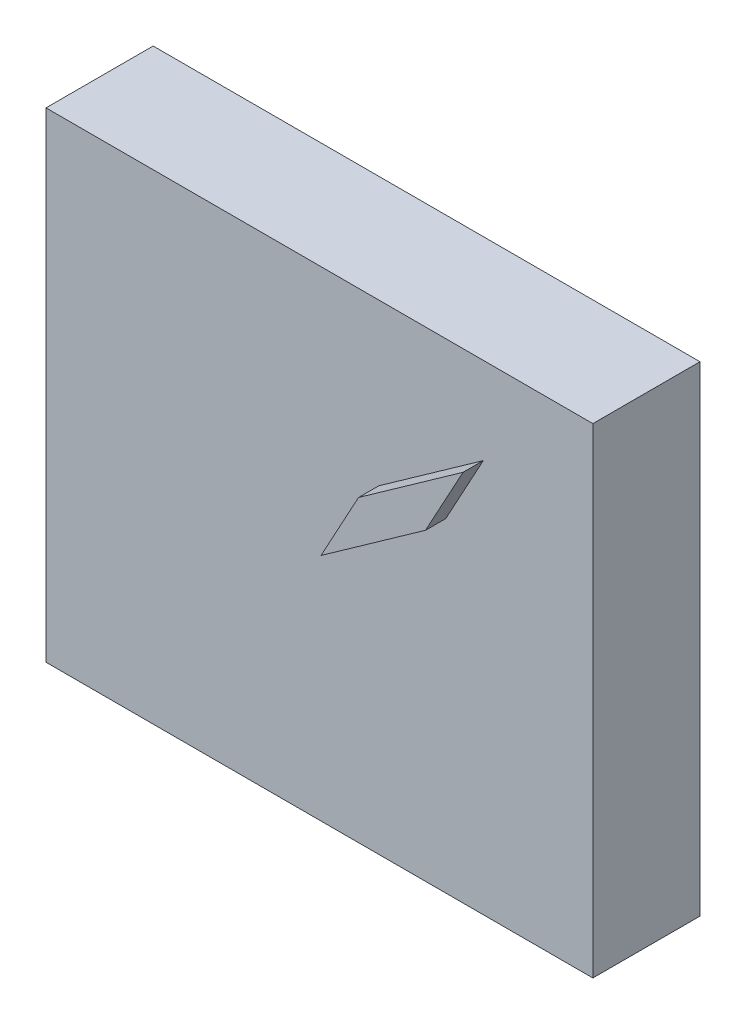
ISO-10303-21;
HEADER;
FILE_DESCRIPTION(('STEP AP214'),'2;1');
FILE_NAME('part.step','',(''),(''),'','','');
FILE_SCHEMA(('AUTOMOTIVE_DESIGN { 1 0 10303 214 1 1 1 1 }'));
ENDSEC;
DATA;
#1=APPLICATION_CONTEXT('core data for automotive mechanical design processes');
#2=APPLICATION_PROTOCOL_DEFINITION('international standard','automotive_design',2000,#1);
#3=PRODUCT_CONTEXT('',#1,'mechanical');
#4=PRODUCT('Part','Part','',(#3));
#5=PRODUCT_RELATED_PRODUCT_CATEGORY('part','',(#4));
#6=PRODUCT_DEFINITION_FORMATION('','',#4);
#7=PRODUCT_DEFINITION_CONTEXT('part definition',#1,'design');
#8=PRODUCT_DEFINITION('design','',#6,#7);
#9=PRODUCT_DEFINITION_SHAPE('','',#8);
#10=(LENGTH_UNIT() NAMED_UNIT(*) SI_UNIT(.MILLI.,.METRE.));
#11=(NAMED_UNIT(*) PLANE_ANGLE_UNIT() SI_UNIT($,.RADIAN.));
#12=(NAMED_UNIT(*) SI_UNIT($,.STERADIAN.) SOLID_ANGLE_UNIT());
#13=UNCERTAINTY_MEASURE_WITH_UNIT(LENGTH_MEASURE(1.E-05),#10,'distance_accuracy_value','');
#14=(GEOMETRIC_REPRESENTATION_CONTEXT(3) GLOBAL_UNCERTAINTY_ASSIGNED_CONTEXT((#13)) GLOBAL_UNIT_ASSIGNED_CONTEXT((#10,
#11,#12)) REPRESENTATION_CONTEXT('',''));
#15=CARTESIAN_POINT('',(0.,0.,0.));
#16=DIRECTION('',(0.,0.,1.));
#17=DIRECTION('',(1.,0.,0.));
#18=AXIS2_PLACEMENT_3D('',#15,#16,#17);
#19=CARTESIAN_POINT('',(0.,0.,10.6));
#20=DIRECTION('',(0.,0.,-1.));
#21=DIRECTION('',(-1.,0.,0.));
#22=AXIS2_PLACEMENT_3D('',#19,#20,#21);
#23=PLANE('',#22);
#24=DIRECTION('',(0.,-1.,0.));
#25=VECTOR('',#24,1.);
#26=CARTESIAN_POINT('',(0.,0.,10.6));
#27=LINE('',#26,#25);
#28=CARTESIAN_POINT('',(0.,47.5,10.6));
#29=VERTEX_POINT('',#28);
#30=CARTESIAN_POINT('',(0.,0.,10.6));
#31=VERTEX_POINT('',#30);
#32=EDGE_CURVE('E130',#29,#31,#27,.T.);
#33=ORIENTED_EDGE('',*,*,#32,.T.);
#34=DIRECTION('',(1.,0.,0.));
#35=VECTOR('',#34,1.);
#36=CARTESIAN_POINT('',(0.,0.,10.6));
#37=LINE('',#36,#35);
#38=CARTESIAN_POINT('',(54.1,0.,10.6));
#39=VERTEX_POINT('',#38);
#40=EDGE_CURVE('E133',#31,#39,#37,.T.);
#41=ORIENTED_EDGE('',*,*,#40,.T.);
#42=DIRECTION('',(0.,1.,0.));
#43=VECTOR('',#42,1.);
#44=CARTESIAN_POINT('',(54.1,0.,10.6));
#45=LINE('',#44,#43);
#46=CARTESIAN_POINT('',(54.1,47.5,10.6));
#47=VERTEX_POINT('',#46);
#48=EDGE_CURVE('E136',#39,#47,#45,.T.);
#49=ORIENTED_EDGE('',*,*,#48,.T.);
#50=DIRECTION('',(-1.,0.,0.));
#51=VECTOR('',#50,1.);
#52=CARTESIAN_POINT('',(0.,47.5,10.6));
#53=LINE('',#52,#51);
#54=EDGE_CURVE('E138',#47,#29,#53,.T.);
#55=ORIENTED_EDGE('',*,*,#54,.T.);
#56=EDGE_LOOP('',(#33,#41,#49,#55));
#57=FACE_BOUND('',#56,.T.);
#58=DIRECTION('',(0.477946829714393,0.878388768123751,0.));
#59=VECTOR('',#58,1.);
#60=CARTESIAN_POINT('',(43.2594392722227,38.9073503521127,10.6));
#61=LINE('',#60,#59);
#62=CARTESIAN_POINT('',(39.5453865369369,32.0815237034792,10.6));
#63=VERTEX_POINT('',#62);
#64=CARTESIAN_POINT('',(43.2594392722227,38.9073503521127,10.6));
#65=VERTEX_POINT('',#64);
#66=EDGE_CURVE('E120',#63,#65,#61,.T.);
#67=ORIENTED_EDGE('',*,*,#66,.F.);
#68=DIRECTION('',(0.815868777571545,0.578237094783716,0.));
#69=VECTOR('',#68,1.);
#70=CARTESIAN_POINT('',(39.5453865369369,32.0815237034792,10.6));
#71=LINE('',#70,#69);
#72=CARTESIAN_POINT('',(29.2062667603302,24.7537980365638,10.6));
#73=VERTEX_POINT('',#72);
#74=EDGE_CURVE('E117',#73,#63,#71,.T.);
#75=ORIENTED_EDGE('',*,*,#74,.F.);
#76=DIRECTION('',(-0.477946829714393,-0.878388768123751,0.));
#77=VECTOR('',#76,1.);
#78=CARTESIAN_POINT('',(32.9203194956161,31.5796246851973,10.6));
#79=LINE('',#78,#77);
#80=CARTESIAN_POINT('',(32.9203194956161,31.5796246851973,10.6));
#81=VERTEX_POINT('',#80);
#82=EDGE_CURVE('E55',#81,#73,#79,.T.);
#83=ORIENTED_EDGE('',*,*,#82,.F.);
#84=DIRECTION('',(-0.815868777571545,-0.578237094783716,0.));
#85=VECTOR('',#84,1.);
#86=CARTESIAN_POINT('',(43.2594392722227,38.9073503521127,10.6));
#87=LINE('',#86,#85);
#88=EDGE_CURVE('E50',#65,#81,#87,.T.);
#89=ORIENTED_EDGE('',*,*,#88,.F.);
#90=EDGE_LOOP('',(#67,#75,#83,#89));
#91=FACE_BOUND('',#90,.T.);
#92=ADVANCED_FACE('F35',(#57,#91),#23,.F.);
#93=CARTESIAN_POINT('',(0.,0.,10.6));
#94=DIRECTION('',(1.,0.,0.));
#95=DIRECTION('',(0.,0.,-1.));
#96=AXIS2_PLACEMENT_3D('',#93,#94,#95);
#97=PLANE('',#96);
#98=DIRECTION('',(0.,-1.,0.));
#99=VECTOR('',#98,1.);
#100=CARTESIAN_POINT('',(0.,0.,0.));
#101=LINE('',#100,#99);
#102=CARTESIAN_POINT('',(0.,47.5,0.));
#103=VERTEX_POINT('',#102);
#104=CARTESIAN_POINT('',(0.,0.,0.));
#105=VERTEX_POINT('',#104);
#106=EDGE_CURVE('E121',#103,#105,#101,.T.);
#107=ORIENTED_EDGE('',*,*,#106,.T.);
#108=DIRECTION('',(0.,0.,-1.));
#109=VECTOR('',#108,1.);
#110=CARTESIAN_POINT('',(0.,0.,10.6));
#111=LINE('',#110,#109);
#112=EDGE_CURVE('E11',#31,#105,#111,.T.);
#113=ORIENTED_EDGE('',*,*,#112,.F.);
#114=ORIENTED_EDGE('',*,*,#32,.F.);
#115=DIRECTION('',(0.,0.,-1.));
#116=VECTOR('',#115,1.);
#117=CARTESIAN_POINT('',(0.,47.5,10.6));
#118=LINE('',#117,#116);
#119=EDGE_CURVE('E139',#29,#103,#118,.T.);
#120=ORIENTED_EDGE('',*,*,#119,.T.);
#121=EDGE_LOOP('',(#107,#113,#114,#120));
#122=FACE_BOUND('',#121,.T.);
#123=ADVANCED_FACE('F37',(#122),#97,.F.);
#124=CARTESIAN_POINT('',(0.,0.,10.6));
#125=DIRECTION('',(0.,1.,0.));
#126=DIRECTION('',(0.,0.,1.));
#127=AXIS2_PLACEMENT_3D('',#124,#125,#126);
#128=PLANE('',#127);
#129=DIRECTION('',(1.,0.,0.));
#130=VECTOR('',#129,1.);
#131=CARTESIAN_POINT('',(0.,0.,0.));
#132=LINE('',#131,#130);
#133=CARTESIAN_POINT('',(54.1,0.,0.));
#134=VERTEX_POINT('',#133);
#135=EDGE_CURVE('E124',#105,#134,#132,.T.);
#136=ORIENTED_EDGE('',*,*,#135,.T.);
#137=DIRECTION('',(0.,0.,-1.));
#138=VECTOR('',#137,1.);
#139=CARTESIAN_POINT('',(54.1,0.,10.6));
#140=LINE('',#139,#138);
#141=EDGE_CURVE('E43',#39,#134,#140,.T.);
#142=ORIENTED_EDGE('',*,*,#141,.F.);
#143=ORIENTED_EDGE('',*,*,#40,.F.);
#144=ORIENTED_EDGE('',*,*,#112,.T.);
#145=EDGE_LOOP('',(#136,#142,#143,#144));
#146=FACE_BOUND('',#145,.T.);
#147=ADVANCED_FACE('F169',(#146),#128,.F.);
#148=CARTESIAN_POINT('',(54.1,0.,10.6));
#149=DIRECTION('',(-1.,0.,0.));
#150=DIRECTION('',(0.,0.,1.));
#151=AXIS2_PLACEMENT_3D('',#148,#149,#150);
#152=PLANE('',#151);
#153=DIRECTION('',(0.,1.,0.));
#154=VECTOR('',#153,1.);
#155=CARTESIAN_POINT('',(54.1,0.,0.));
#156=LINE('',#155,#154);
#157=CARTESIAN_POINT('',(54.1,47.5,0.));
#158=VERTEX_POINT('',#157);
#159=EDGE_CURVE('E142',#134,#158,#156,.T.);
#160=ORIENTED_EDGE('',*,*,#159,.T.);
#161=DIRECTION('',(0.,0.,-1.));
#162=VECTOR('',#161,1.);
#163=CARTESIAN_POINT('',(54.1,47.5,10.6));
#164=LINE('',#163,#162);
#165=EDGE_CURVE('E147',#47,#158,#164,.T.);
#166=ORIENTED_EDGE('',*,*,#165,.F.);
#167=ORIENTED_EDGE('',*,*,#48,.F.);
#168=ORIENTED_EDGE('',*,*,#141,.T.);
#169=EDGE_LOOP('',(#160,#166,#167,#168));
#170=FACE_BOUND('',#169,.T.);
#171=ADVANCED_FACE('F154',(#170),#152,.F.);
#172=CARTESIAN_POINT('',(0.,47.5,10.6));
#173=DIRECTION('',(0.,-1.,0.));
#174=DIRECTION('',(0.,0.,-1.));
#175=AXIS2_PLACEMENT_3D('',#172,#173,#174);
#176=PLANE('',#175);
#177=DIRECTION('',(-1.,0.,0.));
#178=VECTOR('',#177,1.);
#179=CARTESIAN_POINT('',(0.,47.5,0.));
#180=LINE('',#179,#178);
#181=EDGE_CURVE('E134',#158,#103,#180,.T.);
#182=ORIENTED_EDGE('',*,*,#181,.T.);
#183=ORIENTED_EDGE('',*,*,#119,.F.);
#184=ORIENTED_EDGE('',*,*,#54,.F.);
#185=ORIENTED_EDGE('',*,*,#165,.T.);
#186=EDGE_LOOP('',(#182,#183,#184,#185));
#187=FACE_BOUND('',#186,.T.);
#188=ADVANCED_FACE('F163',(#187),#176,.F.);
#189=CARTESIAN_POINT('',(0.,0.,0.));
#190=DIRECTION('',(0.,0.,-1.));
#191=DIRECTION('',(-1.,0.,0.));
#192=AXIS2_PLACEMENT_3D('',#189,#190,#191);
#193=PLANE('',#192);
#194=ORIENTED_EDGE('',*,*,#106,.F.);
#195=ORIENTED_EDGE('',*,*,#181,.F.);
#196=ORIENTED_EDGE('',*,*,#159,.F.);
#197=ORIENTED_EDGE('',*,*,#135,.F.);
#198=EDGE_LOOP('',(#194,#195,#196,#197));
#199=FACE_BOUND('',#198,.T.);
#200=ADVANCED_FACE('F160',(#199),#193,.T.);
#201=CARTESIAN_POINT('',(43.2594392722227,38.9073503521127,12.6));
#202=DIRECTION('',(-0.878388768123751,0.477946829714393,0.));
#203=DIRECTION('',(-0.477946829714393,-0.878388768123751,0.));
#204=AXIS2_PLACEMENT_3D('',#201,#202,#203);
#205=PLANE('',#204);
#206=ORIENTED_EDGE('',*,*,#66,.T.);
#207=DIRECTION('',(0.,0.,-1.));
#208=VECTOR('',#207,1.);
#209=CARTESIAN_POINT('',(43.2594392722227,38.9073503521127,12.6));
#210=LINE('',#209,#208);
#211=CARTESIAN_POINT('',(43.2594392722227,38.9073503521127,12.6));
#212=VERTEX_POINT('',#211);
#213=EDGE_CURVE('E101',#212,#65,#210,.T.);
#214=ORIENTED_EDGE('',*,*,#213,.F.);
#215=DIRECTION('',(0.477946829714393,0.878388768123751,0.));
#216=VECTOR('',#215,1.);
#217=CARTESIAN_POINT('',(43.2594392722227,38.9073503521127,12.6));
#218=LINE('',#217,#216);
#219=CARTESIAN_POINT('',(39.5453865369369,32.0815237034792,12.6));
#220=VERTEX_POINT('',#219);
#221=EDGE_CURVE('E108',#220,#212,#218,.T.);
#222=ORIENTED_EDGE('',*,*,#221,.F.);
#223=DIRECTION('',(0.,0.,-1.));
#224=VECTOR('',#223,1.);
#225=CARTESIAN_POINT('',(39.5453865369369,32.0815237034792,12.6));
#226=LINE('',#225,#224);
#227=EDGE_CURVE('E262',#220,#63,#226,.T.);
#228=ORIENTED_EDGE('',*,*,#227,.T.);
#229=EDGE_LOOP('',(#206,#214,#222,#228));
#230=FACE_BOUND('',#229,.T.);
#231=ADVANCED_FACE('F119',(#230),#205,.F.);
#232=CARTESIAN_POINT('',(43.2594392722227,38.9073503521127,12.6));
#233=DIRECTION('',(0.578237094783716,-0.815868777571545,0.));
#234=DIRECTION('',(0.815868777571545,0.578237094783716,0.));
#235=AXIS2_PLACEMENT_3D('',#232,#233,#234);
#236=PLANE('',#235);
#237=ORIENTED_EDGE('',*,*,#88,.T.);
#238=DIRECTION('',(0.,0.,-1.));
#239=VECTOR('',#238,1.);
#240=CARTESIAN_POINT('',(32.9203194956161,31.5796246851973,12.6));
#241=LINE('',#240,#239);
#242=CARTESIAN_POINT('',(32.9203194956161,31.5796246851973,12.6));
#243=VERTEX_POINT('',#242);
#244=EDGE_CURVE('E104',#243,#81,#241,.T.);
#245=ORIENTED_EDGE('',*,*,#244,.F.);
#246=DIRECTION('',(-0.815868777571545,-0.578237094783716,0.));
#247=VECTOR('',#246,1.);
#248=CARTESIAN_POINT('',(43.2594392722227,38.9073503521127,12.6));
#249=LINE('',#248,#247);
#250=EDGE_CURVE('E97',#212,#243,#249,.T.);
#251=ORIENTED_EDGE('',*,*,#250,.F.);
#252=ORIENTED_EDGE('',*,*,#213,.T.);
#253=EDGE_LOOP('',(#237,#245,#251,#252));
#254=FACE_BOUND('',#253,.T.);
#255=ADVANCED_FACE('F99',(#254),#236,.F.);
#256=CARTESIAN_POINT('',(32.9203194956161,31.5796246851973,12.6));
#257=DIRECTION('',(0.878388768123751,-0.477946829714393,0.));
#258=DIRECTION('',(0.477946829714393,0.878388768123751,0.));
#259=AXIS2_PLACEMENT_3D('',#256,#257,#258);
#260=PLANE('',#259);
#261=ORIENTED_EDGE('',*,*,#82,.T.);
#262=DIRECTION('',(0.,0.,-1.));
#263=VECTOR('',#262,1.);
#264=CARTESIAN_POINT('',(29.2062667603302,24.7537980365638,12.6));
#265=LINE('',#264,#263);
#266=CARTESIAN_POINT('',(29.2062667603302,24.7537980365638,12.6));
#267=VERTEX_POINT('',#266);
#268=EDGE_CURVE('E126',#267,#73,#265,.T.);
#269=ORIENTED_EDGE('',*,*,#268,.F.);
#270=DIRECTION('',(-0.477946829714393,-0.878388768123751,0.));
#271=VECTOR('',#270,1.);
#272=CARTESIAN_POINT('',(32.9203194956161,31.5796246851973,12.6));
#273=LINE('',#272,#271);
#274=EDGE_CURVE('E107',#243,#267,#273,.T.);
#275=ORIENTED_EDGE('',*,*,#274,.F.);
#276=ORIENTED_EDGE('',*,*,#244,.T.);
#277=EDGE_LOOP('',(#261,#269,#275,#276));
#278=FACE_BOUND('',#277,.T.);
#279=ADVANCED_FACE('F205',(#278),#260,.F.);
#280=CARTESIAN_POINT('',(39.5453865369369,32.0815237034792,12.6));
#281=DIRECTION('',(-0.578237094783716,0.815868777571545,0.));
#282=DIRECTION('',(-0.815868777571545,-0.578237094783716,0.));
#283=AXIS2_PLACEMENT_3D('',#280,#281,#282);
#284=PLANE('',#283);
#285=ORIENTED_EDGE('',*,*,#74,.T.);
#286=ORIENTED_EDGE('',*,*,#227,.F.);
#287=DIRECTION('',(0.815868777571545,0.578237094783716,0.));
#288=VECTOR('',#287,1.);
#289=CARTESIAN_POINT('',(39.5453865369369,32.0815237034792,12.6));
#290=LINE('',#289,#288);
#291=EDGE_CURVE('E113',#267,#220,#290,.T.);
#292=ORIENTED_EDGE('',*,*,#291,.F.);
#293=ORIENTED_EDGE('',*,*,#268,.T.);
#294=EDGE_LOOP('',(#285,#286,#292,#293));
#295=FACE_BOUND('',#294,.T.);
#296=ADVANCED_FACE('F211',(#295),#284,.F.);
#297=CARTESIAN_POINT('',(0.,0.,12.6));
#298=DIRECTION('',(0.,0.,-1.));
#299=DIRECTION('',(-1.,0.,0.));
#300=AXIS2_PLACEMENT_3D('',#297,#298,#299);
#301=PLANE('',#300);
#302=ORIENTED_EDGE('',*,*,#221,.T.);
#303=ORIENTED_EDGE('',*,*,#250,.T.);
#304=ORIENTED_EDGE('',*,*,#274,.T.);
#305=ORIENTED_EDGE('',*,*,#291,.T.);
#306=EDGE_LOOP('',(#302,#303,#304,#305));
#307=FACE_BOUND('',#306,.T.);
#308=ADVANCED_FACE('F111',(#307),#301,.F.);
#309=CLOSED_SHELL('',(#92,#123,#147,#171,#188,#200,#231,#255,#279,#296,#308));
#310=MANIFOLD_SOLID_BREP('B2',#309);
#311=ADVANCED_BREP_SHAPE_REPRESENTATION('',(#18,#310),#14);
#312=SHAPE_DEFINITION_REPRESENTATION(#9,#311);
ENDSEC;
END-ISO-10303-21;
